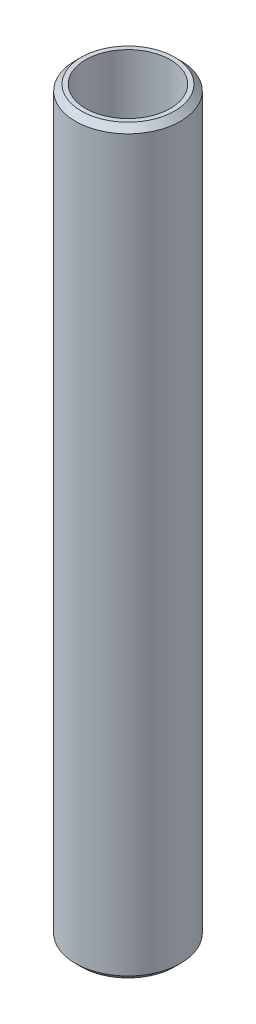
ISO-10303-21;
HEADER;
FILE_DESCRIPTION(('STEP AP214'),'2;1');
FILE_NAME('part.step','',(''),(''),'','','');
FILE_SCHEMA(('AUTOMOTIVE_DESIGN { 1 0 10303 214 1 1 1 1 }'));
ENDSEC;
DATA;
#1=APPLICATION_CONTEXT('core data for automotive mechanical design processes');
#2=APPLICATION_PROTOCOL_DEFINITION('international standard','automotive_design',2000,#1);
#3=PRODUCT_CONTEXT('',#1,'mechanical');
#4=PRODUCT('Part','Part','',(#3));
#5=PRODUCT_RELATED_PRODUCT_CATEGORY('part','',(#4));
#6=PRODUCT_DEFINITION_FORMATION('','',#4);
#7=PRODUCT_DEFINITION_CONTEXT('part definition',#1,'design');
#8=PRODUCT_DEFINITION('design','',#6,#7);
#9=PRODUCT_DEFINITION_SHAPE('','',#8);
#10=(LENGTH_UNIT() NAMED_UNIT(*) SI_UNIT(.MILLI.,.METRE.));
#11=(NAMED_UNIT(*) PLANE_ANGLE_UNIT() SI_UNIT($,.RADIAN.));
#12=(NAMED_UNIT(*) SI_UNIT($,.STERADIAN.) SOLID_ANGLE_UNIT());
#13=UNCERTAINTY_MEASURE_WITH_UNIT(LENGTH_MEASURE(1.E-05),#10,'distance_accuracy_value','');
#14=(GEOMETRIC_REPRESENTATION_CONTEXT(3) GLOBAL_UNCERTAINTY_ASSIGNED_CONTEXT((#13)) GLOBAL_UNIT_ASSIGNED_CONTEXT((#10,
#11,#12)) REPRESENTATION_CONTEXT('',''));
#15=CARTESIAN_POINT('',(0.,0.,0.));
#16=DIRECTION('',(0.,0.,1.));
#17=DIRECTION('',(1.,0.,0.));
#18=AXIS2_PLACEMENT_3D('',#15,#16,#17);
#19=CARTESIAN_POINT('',(0.,563.732478379029,0.));
#20=DIRECTION('',(0.,-1.,0.));
#21=DIRECTION('',(0.,0.,-1.));
#22=AXIS2_PLACEMENT_3D('',#19,#20,#21);
#23=CYLINDRICAL_SURFACE('',#22,40.);
#24=CARTESIAN_POINT('',(0.,559.236432997886,0.));
#25=DIRECTION('',(0.,1.,0.));
#26=DIRECTION('',(0.,0.,1.));
#27=AXIS2_PLACEMENT_3D('',#24,#25,#26);
#28=CIRCLE('',#27,40.);
#29=CARTESIAN_POINT('',(0.,559.236432997886,40.));
#30=VERTEX_POINT('',#29);
#31=EDGE_CURVE('E50',#30,#30,#28,.F.);
#32=ORIENTED_EDGE('',*,*,#31,.T.);
#33=EDGE_LOOP('',(#32));
#34=FACE_BOUND('',#33,.T.);
#35=CARTESIAN_POINT('',(0.,4.49604538114257,0.));
#36=DIRECTION('',(0.,1.,0.));
#37=DIRECTION('',(0.,0.,1.));
#38=AXIS2_PLACEMENT_3D('',#35,#36,#37);
#39=CIRCLE('',#38,40.);
#40=CARTESIAN_POINT('',(0.,4.49604538114257,40.));
#41=VERTEX_POINT('',#40);
#42=EDGE_CURVE('E51',#41,#41,#39,.T.);
#43=ORIENTED_EDGE('',*,*,#42,.T.);
#44=EDGE_LOOP('',(#43));
#45=FACE_BOUND('',#44,.T.);
#46=ADVANCED_FACE('F39',(#34,#45),#23,.T.);
#47=CARTESIAN_POINT('',(0.,563.732478379029,0.));
#48=DIRECTION('',(0.,1.,0.));
#49=DIRECTION('',(0.,0.,1.));
#50=AXIS2_PLACEMENT_3D('',#47,#48,#49);
#51=PLANE('',#50);
#52=CARTESIAN_POINT('',(0.,563.732478379029,0.));
#53=DIRECTION('',(0.,1.,0.));
#54=DIRECTION('',(0.,0.,1.));
#55=AXIS2_PLACEMENT_3D('',#52,#53,#54);
#56=CIRCLE('',#55,35.5039546188573);
#57=CARTESIAN_POINT('',(0.,563.732478379029,35.5039546188573));
#58=VERTEX_POINT('',#57);
#59=EDGE_CURVE('E54',#58,#58,#56,.T.);
#60=ORIENTED_EDGE('',*,*,#59,.T.);
#61=EDGE_LOOP('',(#60));
#62=FACE_BOUND('',#61,.T.);
#63=CARTESIAN_POINT('',(0.,563.732478379029,0.));
#64=DIRECTION('',(0.,1.,0.));
#65=DIRECTION('',(0.,0.,1.));
#66=AXIS2_PLACEMENT_3D('',#63,#64,#65);
#67=CIRCLE('',#66,32.1633723268088);
#68=CARTESIAN_POINT('',(0.,563.732478379029,32.1633723268088));
#69=VERTEX_POINT('',#68);
#70=EDGE_CURVE('E58',#69,#69,#67,.T.);
#71=ORIENTED_EDGE('',*,*,#70,.F.);
#72=EDGE_LOOP('',(#71));
#73=FACE_BOUND('',#72,.T.);
#74=ADVANCED_FACE('F69',(#62,#73),#51,.T.);
#75=CARTESIAN_POINT('',(0.,0.,0.));
#76=DIRECTION('',(0.,1.,0.));
#77=DIRECTION('',(0.,0.,1.));
#78=AXIS2_PLACEMENT_3D('',#75,#76,#77);
#79=PLANE('',#78);
#80=CARTESIAN_POINT('',(0.,0.,0.));
#81=DIRECTION('',(0.,1.,0.));
#82=DIRECTION('',(0.,0.,1.));
#83=AXIS2_PLACEMENT_3D('',#80,#81,#82);
#84=CIRCLE('',#83,35.5039546188574);
#85=CARTESIAN_POINT('',(0.,0.,35.5039546188574));
#86=VERTEX_POINT('',#85);
#87=EDGE_CURVE('E10',#86,#86,#84,.F.);
#88=ORIENTED_EDGE('',*,*,#87,.T.);
#89=EDGE_LOOP('',(#88));
#90=FACE_BOUND('',#89,.T.);
#91=CARTESIAN_POINT('',(0.,0.,0.));
#92=DIRECTION('',(0.,1.,0.));
#93=DIRECTION('',(0.,0.,1.));
#94=AXIS2_PLACEMENT_3D('',#91,#92,#93);
#95=CIRCLE('',#94,32.1633723268088);
#96=CARTESIAN_POINT('',(0.,0.,32.1633723268088));
#97=VERTEX_POINT('',#96);
#98=EDGE_CURVE('E63',#97,#97,#95,.T.);
#99=ORIENTED_EDGE('',*,*,#98,.T.);
#100=EDGE_LOOP('',(#99));
#101=FACE_BOUND('',#100,.T.);
#102=ADVANCED_FACE('F75',(#90,#101),#79,.F.);
#103=CARTESIAN_POINT('',(0.,563.732478379029,0.));
#104=DIRECTION('',(0.,-1.,0.));
#105=DIRECTION('',(0.,0.,-1.));
#106=AXIS2_PLACEMENT_3D('',#103,#104,#105);
#107=CYLINDRICAL_SURFACE('',#106,32.1633723268088);
#108=ORIENTED_EDGE('',*,*,#70,.T.);
#109=EDGE_LOOP('',(#108));
#110=FACE_BOUND('',#109,.T.);
#111=ORIENTED_EDGE('',*,*,#98,.F.);
#112=EDGE_LOOP('',(#111));
#113=FACE_BOUND('',#112,.T.);
#114=ADVANCED_FACE('F70',(#110,#113),#107,.F.);
#115=CARTESIAN_POINT('',(0.,563.732478379029,0.));
#116=DIRECTION('',(0.,-1.,0.));
#117=DIRECTION('',(0.,0.,-1.));
#118=AXIS2_PLACEMENT_3D('',#115,#116,#117);
#119=CONICAL_SURFACE('',#118,35.5039546188573,0.785398163397438);
#120=ORIENTED_EDGE('',*,*,#31,.F.);
#121=EDGE_LOOP('',(#120));
#122=FACE_BOUND('',#121,.T.);
#123=ORIENTED_EDGE('',*,*,#59,.F.);
#124=EDGE_LOOP('',(#123));
#125=FACE_BOUND('',#124,.T.);
#126=ADVANCED_FACE('F81',(#122,#125),#119,.T.);
#127=CARTESIAN_POINT('',(0.,4.49604538114257,0.));
#128=DIRECTION('',(0.,1.,0.));
#129=DIRECTION('',(0.,0.,1.));
#130=AXIS2_PLACEMENT_3D('',#127,#128,#129);
#131=CONICAL_SURFACE('',#130,40.,0.785398163397451);
#132=ORIENTED_EDGE('',*,*,#87,.F.);
#133=EDGE_LOOP('',(#132));
#134=FACE_BOUND('',#133,.T.);
#135=ORIENTED_EDGE('',*,*,#42,.F.);
#136=EDGE_LOOP('',(#135));
#137=FACE_BOUND('',#136,.T.);
#138=ADVANCED_FACE('F45',(#134,#137),#131,.T.);
#139=CLOSED_SHELL('',(#46,#74,#102,#114,#126,#138));
#140=MANIFOLD_SOLID_BREP('B2',#139);
#141=ADVANCED_BREP_SHAPE_REPRESENTATION('',(#18,#140),#14);
#142=SHAPE_DEFINITION_REPRESENTATION(#9,#141);
ENDSEC;
END-ISO-10303-21;
